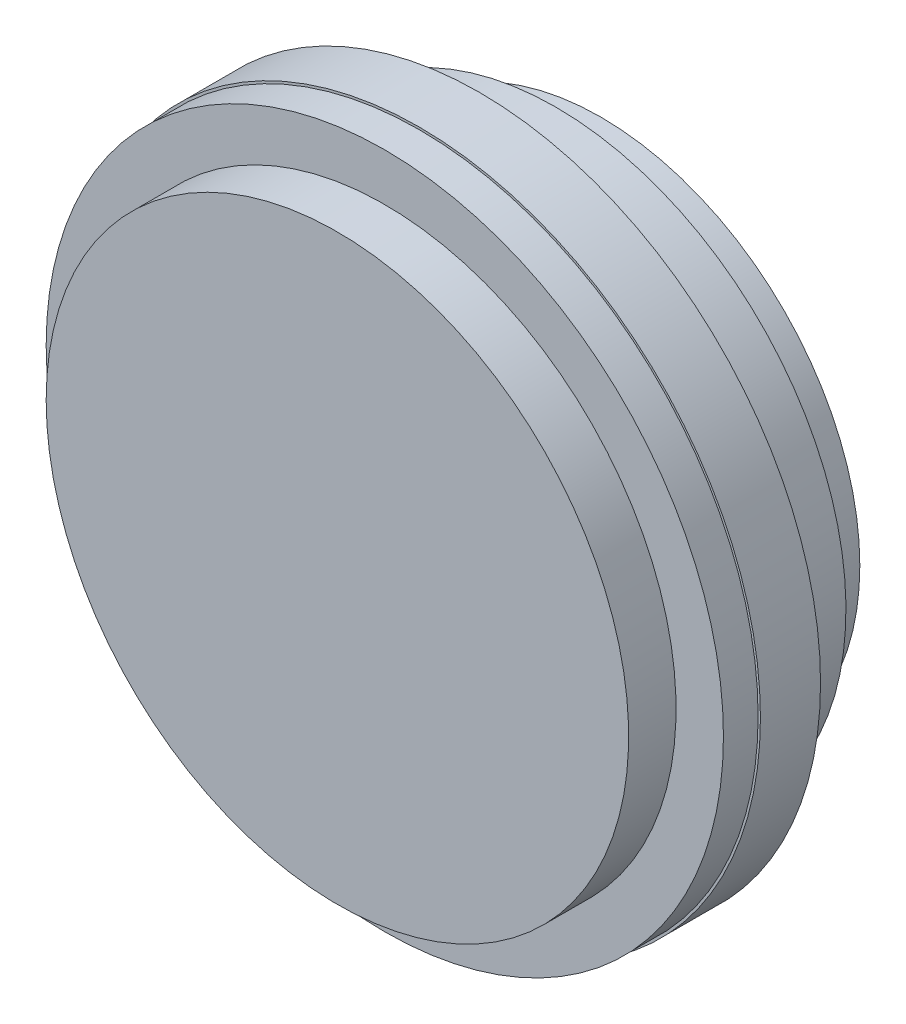
ISO-10303-21;
HEADER;
FILE_DESCRIPTION(('STEP AP214'),'2;1');
FILE_NAME('part.step','',(''),(''),'','','');
FILE_SCHEMA(('AUTOMOTIVE_DESIGN { 1 0 10303 214 1 1 1 1 }'));
ENDSEC;
DATA;
#1=APPLICATION_CONTEXT('core data for automotive mechanical design processes');
#2=APPLICATION_PROTOCOL_DEFINITION('international standard','automotive_design',2000,#1);
#3=PRODUCT_CONTEXT('',#1,'mechanical');
#4=PRODUCT('Part','Part','',(#3));
#5=PRODUCT_RELATED_PRODUCT_CATEGORY('part','',(#4));
#6=PRODUCT_DEFINITION_FORMATION('','',#4);
#7=PRODUCT_DEFINITION_CONTEXT('part definition',#1,'design');
#8=PRODUCT_DEFINITION('design','',#6,#7);
#9=PRODUCT_DEFINITION_SHAPE('','',#8);
#10=(LENGTH_UNIT() NAMED_UNIT(*) SI_UNIT(.MILLI.,.METRE.));
#11=(NAMED_UNIT(*) PLANE_ANGLE_UNIT() SI_UNIT($,.RADIAN.));
#12=(NAMED_UNIT(*) SI_UNIT($,.STERADIAN.) SOLID_ANGLE_UNIT());
#13=UNCERTAINTY_MEASURE_WITH_UNIT(LENGTH_MEASURE(1.E-05),#10,'distance_accuracy_value','');
#14=(GEOMETRIC_REPRESENTATION_CONTEXT(3) GLOBAL_UNCERTAINTY_ASSIGNED_CONTEXT((#13)) GLOBAL_UNIT_ASSIGNED_CONTEXT((#10,
#11,#12)) REPRESENTATION_CONTEXT('',''));
#15=CARTESIAN_POINT('',(0.,0.,0.));
#16=DIRECTION('',(0.,0.,1.));
#17=DIRECTION('',(1.,0.,0.));
#18=AXIS2_PLACEMENT_3D('',#15,#16,#17);
#19=CARTESIAN_POINT('',(0.,0.,42.9036521739131));
#20=DIRECTION('',(0.,0.,-1.));
#21=DIRECTION('',(-1.,0.,0.));
#22=AXIS2_PLACEMENT_3D('',#19,#20,#21);
#23=CYLINDRICAL_SURFACE('',#22,126.);
#24=CARTESIAN_POINT('',(0.,0.,32.5));
#25=DIRECTION('',(0.,0.,-1.));
#26=DIRECTION('',(-1.,0.,0.));
#27=AXIS2_PLACEMENT_3D('',#24,#25,#26);
#28=CIRCLE('',#27,126.);
#29=CARTESIAN_POINT('',(-126.,0.,32.5));
#30=VERTEX_POINT('',#29);
#31=EDGE_CURVE('E57',#30,#30,#28,.T.);
#32=ORIENTED_EDGE('',*,*,#31,.T.);
#33=EDGE_LOOP('',(#32));
#34=FACE_BOUND('',#33,.T.);
#35=CARTESIAN_POINT('',(0.,0.,22.5));
#36=DIRECTION('',(0.,0.,-1.));
#37=DIRECTION('',(-1.,0.,0.));
#38=AXIS2_PLACEMENT_3D('',#35,#36,#37);
#39=CIRCLE('',#38,126.);
#40=CARTESIAN_POINT('',(-126.,0.,22.5));
#41=VERTEX_POINT('',#40);
#42=EDGE_CURVE('E34',#41,#41,#39,.T.);
#43=ORIENTED_EDGE('',*,*,#42,.F.);
#44=EDGE_LOOP('',(#43));
#45=FACE_BOUND('',#44,.T.);
#46=ADVANCED_FACE('F15',(#34,#45),#23,.T.);
#47=CARTESIAN_POINT('',(0.,0.,42.9036521739131));
#48=DIRECTION('',(0.,0.,-1.));
#49=DIRECTION('',(-1.,0.,0.));
#50=AXIS2_PLACEMENT_3D('',#47,#48,#49);
#51=CYLINDRICAL_SURFACE('',#50,147.5);
#52=CARTESIAN_POINT('',(0.,0.,58.5));
#53=DIRECTION('',(0.,0.,-1.));
#54=DIRECTION('',(-1.,0.,0.));
#55=AXIS2_PLACEMENT_3D('',#52,#53,#54);
#56=CIRCLE('',#55,147.5);
#57=CARTESIAN_POINT('',(-147.5,0.,58.5));
#58=VERTEX_POINT('',#57);
#59=EDGE_CURVE('E10',#58,#58,#56,.T.);
#60=ORIENTED_EDGE('',*,*,#59,.T.);
#61=EDGE_LOOP('',(#60));
#62=FACE_BOUND('',#61,.T.);
#63=CARTESIAN_POINT('',(0.,0.,32.5));
#64=DIRECTION('',(0.,0.,-1.));
#65=DIRECTION('',(-1.,0.,0.));
#66=AXIS2_PLACEMENT_3D('',#63,#64,#65);
#67=CIRCLE('',#66,147.5);
#68=CARTESIAN_POINT('',(-147.5,0.,32.5));
#69=VERTEX_POINT('',#68);
#70=EDGE_CURVE('E31',#69,#69,#67,.T.);
#71=ORIENTED_EDGE('',*,*,#70,.F.);
#72=EDGE_LOOP('',(#71));
#73=FACE_BOUND('',#72,.T.);
#74=ADVANCED_FACE('F64',(#62,#73),#51,.T.);
#75=CARTESIAN_POINT('',(-147.5,0.,32.5));
#76=DIRECTION('',(0.,0.,1.));
#77=DIRECTION('',(1.,0.,0.));
#78=AXIS2_PLACEMENT_3D('',#75,#76,#77);
#79=PLANE('',#78);
#80=ORIENTED_EDGE('',*,*,#31,.F.);
#81=EDGE_LOOP('',(#80));
#82=FACE_BOUND('',#81,.T.);
#83=ORIENTED_EDGE('',*,*,#70,.T.);
#84=EDGE_LOOP('',(#83));
#85=FACE_BOUND('',#84,.T.);
#86=ADVANCED_FACE('F62',(#82,#85),#79,.F.);
#87=CARTESIAN_POINT('',(0.,62.75,22.5));
#88=DIRECTION('',(0.,0.,-1.));
#89=DIRECTION('',(-1.,0.,0.));
#90=AXIS2_PLACEMENT_3D('',#87,#88,#89);
#91=PLANE('',#90);
#92=CARTESIAN_POINT('',(0.,0.,22.5));
#93=DIRECTION('',(0.,0.,1.));
#94=DIRECTION('',(0.,1.,0.));
#95=AXIS2_PLACEMENT_3D('',#92,#93,#94);
#96=CIRCLE('',#95,125.5);
#97=CARTESIAN_POINT('',(0.,125.5,22.5));
#98=VERTEX_POINT('',#97);
#99=EDGE_CURVE('E37',#98,#98,#96,.T.);
#100=ORIENTED_EDGE('',*,*,#99,.T.);
#101=EDGE_LOOP('',(#100));
#102=FACE_BOUND('',#101,.T.);
#103=ORIENTED_EDGE('',*,*,#42,.T.);
#104=EDGE_LOOP('',(#103));
#105=FACE_BOUND('',#104,.T.);
#106=ADVANCED_FACE('F72',(#102,#105),#91,.T.);
#107=CARTESIAN_POINT('',(0.,0.,22.5));
#108=DIRECTION('',(0.,0.,-1.));
#109=DIRECTION('',(-1.,0.,0.));
#110=AXIS2_PLACEMENT_3D('',#107,#108,#109);
#111=CYLINDRICAL_SURFACE('',#110,125.5);
#112=ORIENTED_EDGE('',*,*,#99,.F.);
#113=EDGE_LOOP('',(#112));
#114=FACE_BOUND('',#113,.T.);
#115=CARTESIAN_POINT('',(0.,0.,-0.499999999999988));
#116=DIRECTION('',(0.,0.,1.));
#117=DIRECTION('',(0.,1.,0.));
#118=AXIS2_PLACEMENT_3D('',#115,#116,#117);
#119=CIRCLE('',#118,125.5);
#120=CARTESIAN_POINT('',(0.,125.5,-0.499999999999988));
#121=VERTEX_POINT('',#120);
#122=EDGE_CURVE('E44',#121,#121,#119,.T.);
#123=ORIENTED_EDGE('',*,*,#122,.T.);
#124=EDGE_LOOP('',(#123));
#125=FACE_BOUND('',#124,.T.);
#126=ADVANCED_FACE('F108',(#114,#125),#111,.T.);
#127=CARTESIAN_POINT('',(-112.,0.,-20.));
#128=DIRECTION('',(0.,0.,1.));
#129=DIRECTION('',(1.,0.,0.));
#130=AXIS2_PLACEMENT_3D('',#127,#128,#129);
#131=PLANE('',#130);
#132=CARTESIAN_POINT('',(0.,0.,-20.));
#133=DIRECTION('',(0.,0.,-1.));
#134=DIRECTION('',(-1.,0.,0.));
#135=AXIS2_PLACEMENT_3D('',#132,#133,#134);
#136=CIRCLE('',#135,112.);
#137=CARTESIAN_POINT('',(-112.,0.,-20.));
#138=VERTEX_POINT('',#137);
#139=EDGE_CURVE('E36',#138,#138,#136,.T.);
#140=ORIENTED_EDGE('',*,*,#139,.T.);
#141=EDGE_LOOP('',(#140));
#142=FACE_BOUND('',#141,.T.);
#143=ADVANCED_FACE('F111',(#142),#131,.F.);
#144=CARTESIAN_POINT('',(0.,0.,42.9036521739131));
#145=DIRECTION('',(0.,0.,-1.));
#146=DIRECTION('',(-1.,0.,0.));
#147=AXIS2_PLACEMENT_3D('',#144,#145,#146);
#148=CYLINDRICAL_SURFACE('',#147,112.);
#149=ORIENTED_EDGE('',*,*,#139,.F.);
#150=EDGE_LOOP('',(#149));
#151=FACE_BOUND('',#150,.T.);
#152=CARTESIAN_POINT('',(0.,0.,-0.499999999999987));
#153=DIRECTION('',(0.,0.,-1.));
#154=DIRECTION('',(-1.,0.,0.));
#155=AXIS2_PLACEMENT_3D('',#152,#153,#154);
#156=CIRCLE('',#155,112.);
#157=CARTESIAN_POINT('',(-112.,0.,-0.499999999999987));
#158=VERTEX_POINT('',#157);
#159=EDGE_CURVE('E41',#158,#158,#156,.T.);
#160=ORIENTED_EDGE('',*,*,#159,.T.);
#161=EDGE_LOOP('',(#160));
#162=FACE_BOUND('',#161,.T.);
#163=ADVANCED_FACE('F115',(#151,#162),#148,.T.);
#164=CARTESIAN_POINT('',(-126.,0.,-0.499999999999988));
#165=DIRECTION('',(0.,0.,1.));
#166=DIRECTION('',(1.,0.,0.));
#167=AXIS2_PLACEMENT_3D('',#164,#165,#166);
#168=PLANE('',#167);
#169=ORIENTED_EDGE('',*,*,#122,.F.);
#170=EDGE_LOOP('',(#169));
#171=FACE_BOUND('',#170,.T.);
#172=ORIENTED_EDGE('',*,*,#159,.F.);
#173=EDGE_LOOP('',(#172));
#174=FACE_BOUND('',#173,.T.);
#175=ADVANCED_FACE('F100',(#171,#174),#168,.F.);
#176=CARTESIAN_POINT('',(0.,-146.5,58.5));
#177=DIRECTION('',(0.,0.,-1.));
#178=DIRECTION('',(-1.,0.,0.));
#179=AXIS2_PLACEMENT_3D('',#176,#177,#178);
#180=PLANE('',#179);
#181=ORIENTED_EDGE('',*,*,#59,.F.);
#182=EDGE_LOOP('',(#181));
#183=FACE_BOUND('',#182,.T.);
#184=CARTESIAN_POINT('',(0.,0.,58.5));
#185=DIRECTION('',(0.,0.,-1.));
#186=DIRECTION('',(-1.,0.,0.));
#187=AXIS2_PLACEMENT_3D('',#184,#185,#186);
#188=CIRCLE('',#187,146.5);
#189=CARTESIAN_POINT('',(-146.5,0.,58.5));
#190=VERTEX_POINT('',#189);
#191=EDGE_CURVE('E50',#190,#190,#188,.T.);
#192=ORIENTED_EDGE('',*,*,#191,.T.);
#193=EDGE_LOOP('',(#192));
#194=FACE_BOUND('',#193,.T.);
#195=ADVANCED_FACE('F94',(#183,#194),#180,.F.);
#196=CARTESIAN_POINT('',(0.,0.,-57.));
#197=DIRECTION('',(0.,0.,-1.));
#198=DIRECTION('',(-1.,0.,0.));
#199=AXIS2_PLACEMENT_3D('',#196,#197,#198);
#200=CYLINDRICAL_SURFACE('',#199,146.5);
#201=ORIENTED_EDGE('',*,*,#191,.F.);
#202=EDGE_LOOP('',(#201));
#203=FACE_BOUND('',#202,.T.);
#204=CARTESIAN_POINT('',(0.,0.,73.5));
#205=DIRECTION('',(0.,0.,-1.));
#206=DIRECTION('',(-1.,0.,0.));
#207=AXIS2_PLACEMENT_3D('',#204,#205,#206);
#208=CIRCLE('',#207,146.5);
#209=CARTESIAN_POINT('',(-146.5,0.,73.5));
#210=VERTEX_POINT('',#209);
#211=EDGE_CURVE('E356',#210,#210,#208,.T.);
#212=ORIENTED_EDGE('',*,*,#211,.T.);
#213=EDGE_LOOP('',(#212));
#214=FACE_BOUND('',#213,.T.);
#215=ADVANCED_FACE('F87',(#203,#214),#200,.T.);
#216=CARTESIAN_POINT('',(-126.,0.,94.));
#217=DIRECTION('',(0.,0.,-1.));
#218=DIRECTION('',(-1.,0.,0.));
#219=AXIS2_PLACEMENT_3D('',#216,#217,#218);
#220=PLANE('',#219);
#221=CARTESIAN_POINT('',(0.,0.,94.));
#222=DIRECTION('',(0.,0.,-1.));
#223=DIRECTION('',(-1.,0.,0.));
#224=AXIS2_PLACEMENT_3D('',#221,#222,#223);
#225=CIRCLE('',#224,126.);
#226=CARTESIAN_POINT('',(-126.,0.,94.));
#227=VERTEX_POINT('',#226);
#228=EDGE_CURVE('E22',#227,#227,#225,.T.);
#229=ORIENTED_EDGE('',*,*,#228,.F.);
#230=EDGE_LOOP('',(#229));
#231=FACE_BOUND('',#230,.T.);
#232=ADVANCED_FACE('F17',(#231),#220,.F.);
#233=CARTESIAN_POINT('',(0.,0.,42.9036521739131));
#234=DIRECTION('',(0.,0.,-1.));
#235=DIRECTION('',(-1.,0.,0.));
#236=AXIS2_PLACEMENT_3D('',#233,#234,#235);
#237=CYLINDRICAL_SURFACE('',#236,126.);
#238=CARTESIAN_POINT('',(0.,0.,73.5));
#239=DIRECTION('',(0.,0.,-1.));
#240=DIRECTION('',(-1.,0.,0.));
#241=AXIS2_PLACEMENT_3D('',#238,#239,#240);
#242=CIRCLE('',#241,126.);
#243=CARTESIAN_POINT('',(-126.,0.,73.5));
#244=VERTEX_POINT('',#243);
#245=EDGE_CURVE('E26',#244,#244,#242,.T.);
#246=ORIENTED_EDGE('',*,*,#245,.F.);
#247=EDGE_LOOP('',(#246));
#248=FACE_BOUND('',#247,.T.);
#249=ORIENTED_EDGE('',*,*,#228,.T.);
#250=EDGE_LOOP('',(#249));
#251=FACE_BOUND('',#250,.T.);
#252=ADVANCED_FACE('F80',(#248,#251),#237,.T.);
#253=CARTESIAN_POINT('',(-126.,0.,73.5));
#254=DIRECTION('',(0.,0.,-1.));
#255=DIRECTION('',(-1.,0.,0.));
#256=AXIS2_PLACEMENT_3D('',#253,#254,#255);
#257=PLANE('',#256);
#258=ORIENTED_EDGE('',*,*,#211,.F.);
#259=EDGE_LOOP('',(#258));
#260=FACE_BOUND('',#259,.T.);
#261=ORIENTED_EDGE('',*,*,#245,.T.);
#262=EDGE_LOOP('',(#261));
#263=FACE_BOUND('',#262,.T.);
#264=ADVANCED_FACE('F78',(#260,#263),#257,.F.);
#265=CLOSED_SHELL('',(#46,#74,#86,#106,#126,#143,#163,#175,#195,#215,#232,#252,#264));
#266=MANIFOLD_SOLID_BREP('B1',#265);
#267=ADVANCED_BREP_SHAPE_REPRESENTATION('',(#18,#266),#14);
#268=SHAPE_DEFINITION_REPRESENTATION(#9,#267);
ENDSEC;
END-ISO-10303-21;
